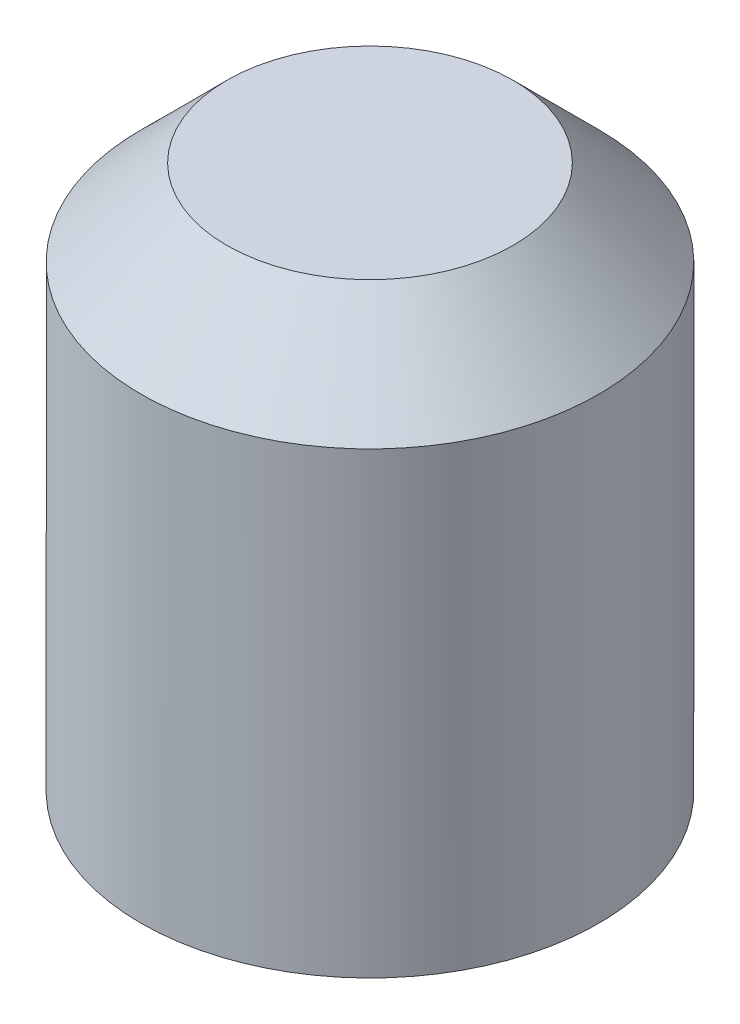
ISO-10303-21;
HEADER;
FILE_DESCRIPTION(('STEP AP214'),'2;1');
FILE_NAME('part.step','',(''),(''),'','','');
FILE_SCHEMA(('AUTOMOTIVE_DESIGN { 1 0 10303 214 1 1 1 1 }'));
ENDSEC;
DATA;
#1=APPLICATION_CONTEXT('core data for automotive mechanical design processes');
#2=APPLICATION_PROTOCOL_DEFINITION('international standard','automotive_design',2000,#1);
#3=PRODUCT_CONTEXT('',#1,'mechanical');
#4=PRODUCT('Part','Part','',(#3));
#5=PRODUCT_RELATED_PRODUCT_CATEGORY('part','',(#4));
#6=PRODUCT_DEFINITION_FORMATION('','',#4);
#7=PRODUCT_DEFINITION_CONTEXT('part definition',#1,'design');
#8=PRODUCT_DEFINITION('design','',#6,#7);
#9=PRODUCT_DEFINITION_SHAPE('','',#8);
#10=(LENGTH_UNIT() NAMED_UNIT(*) SI_UNIT(.MILLI.,.METRE.));
#11=(NAMED_UNIT(*) PLANE_ANGLE_UNIT() SI_UNIT($,.RADIAN.));
#12=(NAMED_UNIT(*) SI_UNIT($,.STERADIAN.) SOLID_ANGLE_UNIT());
#13=UNCERTAINTY_MEASURE_WITH_UNIT(LENGTH_MEASURE(1.E-05),#10,'distance_accuracy_value','');
#14=(GEOMETRIC_REPRESENTATION_CONTEXT(3) GLOBAL_UNCERTAINTY_ASSIGNED_CONTEXT((#13)) GLOBAL_UNIT_ASSIGNED_CONTEXT((#10,
#11,#12)) REPRESENTATION_CONTEXT('',''));
#15=CARTESIAN_POINT('',(0.,0.,0.));
#16=DIRECTION('',(0.,0.,1.));
#17=DIRECTION('',(1.,0.,0.));
#18=AXIS2_PLACEMENT_3D('',#15,#16,#17);
#19=CARTESIAN_POINT('',(7.87735026918963,-10.,1.));
#20=DIRECTION('',(0.,0.,1.));
#21=DIRECTION('',(1.,0.,0.));
#22=AXIS2_PLACEMENT_3D('',#19,#20,#21);
#23=PLANE('',#22);
#24=DIRECTION('',(0.,1.,0.));
#25=VECTOR('',#24,1.);
#26=CARTESIAN_POINT('',(6.72264973081037,-10.,1.));
#27=LINE('',#26,#25);
#28=CARTESIAN_POINT('',(6.72264973079268,-9.99999999997048,1.00000000003064));
#29=VERTEX_POINT('',#28);
#30=CARTESIAN_POINT('',(6.72264973081037,-8.5,1.));
#31=VERTEX_POINT('',#30);
#32=EDGE_CURVE('E74',#29,#31,#27,.T.);
#33=ORIENTED_EDGE('',*,*,#32,.T.);
#34=DIRECTION('',(1.,0.,0.));
#35=VECTOR('',#34,1.);
#36=CARTESIAN_POINT('',(7.3,-8.5,1.));
#37=LINE('',#36,#35);
#38=CARTESIAN_POINT('',(7.87735026918963,-8.5,0.999999999999999));
#39=VERTEX_POINT('',#38);
#40=EDGE_CURVE('E261',#31,#39,#37,.T.);
#41=ORIENTED_EDGE('',*,*,#40,.T.);
#42=DIRECTION('',(0.,1.,0.));
#43=VECTOR('',#42,1.);
#44=CARTESIAN_POINT('',(7.87735026918963,-10.,0.999999999999998));
#45=LINE('',#44,#43);
#46=CARTESIAN_POINT('',(7.87735026920732,-9.99999999997048,1.00000000003064));
#47=VERTEX_POINT('',#46);
#48=EDGE_CURVE('E77',#39,#47,#45,.F.);
#49=ORIENTED_EDGE('',*,*,#48,.T.);
#50=CARTESIAN_POINT('',(6.72264973078712,-9.99999999995726,0.999999999999238));
#51=CARTESIAN_POINT('',(6.77004446289407,-9.98631688639026,0.999999999999726));
#52=CARTESIAN_POINT('',(6.81781412940723,-9.97378960990906,0.999999999999927));
#53=CARTESIAN_POINT('',(6.91412944758816,-9.95164920310437,1.00000000000007));
#54=CARTESIAN_POINT('',(6.96267658444085,-9.94204259300488,1.00000000000002));
#55=CARTESIAN_POINT('',(7.05922611583835,-9.92659400094843,0.999999999999981));
#56=CARTESIAN_POINT('',(7.10721491697941,-9.92066965356561,0.999999999999995));
#57=CARTESIAN_POINT('',(7.2034693839164,-9.91271656859405,1.00000000000001));
#58=CARTESIAN_POINT('',(7.25173469195837,-9.91068360245897,1.));
#59=CARTESIAN_POINT('',(7.34826530804225,-9.91068360245899,0.999999999999999));
#60=CARTESIAN_POINT('',(7.39653061608415,-9.91271656859409,1.));
#61=CARTESIAN_POINT('',(7.49278508302101,-9.92066965356565,1.));
#62=CARTESIAN_POINT('',(7.54077388416201,-9.92659400094847,1.));
#63=CARTESIAN_POINT('',(7.63732341555937,-9.94204259300493,1.));
#64=CARTESIAN_POINT('',(7.68587055241198,-9.95164920310445,1.));
#65=CARTESIAN_POINT('',(7.7821858705928,-9.97378960990902,1.));
#66=CARTESIAN_POINT('',(7.82995553710592,-9.98631688639008,1.));
#67=CARTESIAN_POINT('',(7.87735026921288,-9.99999999995676,1.));
#68=B_SPLINE_CURVE_WITH_KNOTS('',3,(#50,#51,#52,#53,#54,#55,#56,#57,#58,#59,#60,#61,#62,#63,#64,
#65,#66,#67),.UNSPECIFIED.,.F.,.F.,(4,2,2,2,2,2,2,2,4),(0.,0.148036697966093,0.296401493059084,
0.441315429606034,0.586071806689552,0.730828183772874,0.875742120319628,1.02410691541241,
1.17214361337829),.UNSPECIFIED.);
#69=EDGE_CURVE('E21',#29,#47,#68,.T.);
#70=ORIENTED_EDGE('',*,*,#69,.F.);
#71=EDGE_LOOP('',(#33,#41,#49,#70));
#72=FACE_BOUND('',#71,.T.);
#73=ADVANCED_FACE('F17',(#72),#23,.F.);
#74=CARTESIAN_POINT('',(6.72264973081037,-10.,-1.));
#75=DIRECTION('',(0.,0.,-1.));
#76=DIRECTION('',(-1.,0.,0.));
#77=AXIS2_PLACEMENT_3D('',#74,#75,#76);
#78=PLANE('',#77);
#79=DIRECTION('',(0.,1.,0.));
#80=VECTOR('',#79,1.);
#81=CARTESIAN_POINT('',(7.87735026918963,-10.,-1.));
#82=LINE('',#81,#80);
#83=CARTESIAN_POINT('',(7.87735026916594,-9.99999999997385,-1.00000000006128));
#84=VERTEX_POINT('',#83);
#85=CARTESIAN_POINT('',(7.87735026918963,-8.5,-1.));
#86=VERTEX_POINT('',#85);
#87=EDGE_CURVE('E225',#84,#86,#82,.T.);
#88=ORIENTED_EDGE('',*,*,#87,.T.);
#89=DIRECTION('',(1.,0.,0.));
#90=VECTOR('',#89,1.);
#91=CARTESIAN_POINT('',(7.3,-8.5,-1.));
#92=LINE('',#91,#90);
#93=CARTESIAN_POINT('',(6.72264973081037,-8.5,-0.999999999999999));
#94=VERTEX_POINT('',#93);
#95=EDGE_CURVE('E170',#86,#94,#92,.F.);
#96=ORIENTED_EDGE('',*,*,#95,.T.);
#97=DIRECTION('',(0.,1.,0.));
#98=VECTOR('',#97,1.);
#99=CARTESIAN_POINT('',(6.72264973081037,-10.,-0.999999999999998));
#100=LINE('',#99,#98);
#101=CARTESIAN_POINT('',(6.72264973079268,-9.99999999997048,-1.00000000003064));
#102=VERTEX_POINT('',#101);
#103=EDGE_CURVE('E89',#94,#102,#100,.F.);
#104=ORIENTED_EDGE('',*,*,#103,.T.);
#105=CARTESIAN_POINT('',(7.87735026921289,-9.99999999995726,-0.999999999999238));
#106=CARTESIAN_POINT('',(7.82995553710598,-9.98631688639028,-0.999999999999726));
#107=CARTESIAN_POINT('',(7.78218587059287,-9.97378960990909,-0.999999999999927));
#108=CARTESIAN_POINT('',(7.68587055241204,-9.95164920310441,-1.00000000000007));
#109=CARTESIAN_POINT('',(7.63732341555941,-9.94204259300493,-1.00000000000002));
#110=CARTESIAN_POINT('',(7.54077388416201,-9.92659400094848,-0.999999999999981));
#111=CARTESIAN_POINT('',(7.492785083021,-9.92066965356565,-0.999999999999995));
#112=CARTESIAN_POINT('',(7.3965306160841,-9.91271656859408,-1.00000000000001));
#113=CARTESIAN_POINT('',(7.34826530804218,-9.91068360245898,-1.));
#114=CARTESIAN_POINT('',(7.25173469195867,-9.91068360245897,-0.999999999999999));
#115=CARTESIAN_POINT('',(7.20346938391709,-9.91271656859403,-1.));
#116=CARTESIAN_POINT('',(7.10721491698086,-9.92066965356545,-1.));
#117=CARTESIAN_POINT('',(7.05922611584017,-9.92659400094818,-1.));
#118=CARTESIAN_POINT('',(6.96267658444344,-9.94204259300442,-1.));
#119=CARTESIAN_POINT('',(6.91412944759115,-9.9516492031038,-1.));
#120=CARTESIAN_POINT('',(6.81781412941096,-9.97378960990809,-1.));
#121=CARTESIAN_POINT('',(6.77004446289814,-9.98631688638899,-1.));
#122=CARTESIAN_POINT('',(6.72264973079148,-9.9999999999555,-1.));
#123=B_SPLINE_CURVE_WITH_KNOTS('',3,(#105,#106,#107,#108,#109,#110,#111,#112,#113,#114,#115,
#116,#117,#118,#119,#120,#121,#122),.UNSPECIFIED.,.F.,.F.,(4,2,2,2,2,2,2,2,4),(0.,
0.148036697965939,0.296401493058774,0.44131542960558,0.586071806688958,0.730828183771323,
0.875742120317116,1.02410691540888,1.17214361337376),.UNSPECIFIED.);
#124=EDGE_CURVE('E78',#84,#102,#123,.T.);
#125=ORIENTED_EDGE('',*,*,#124,.F.);
#126=EDGE_LOOP('',(#88,#96,#104,#125));
#127=FACE_BOUND('',#126,.T.);
#128=ADVANCED_FACE('F162',(#127),#78,.F.);
#129=CARTESIAN_POINT('',(7.3,-8.5,0.));
#130=DIRECTION('',(0.,1.,0.));
#131=DIRECTION('',(0.,0.,1.));
#132=AXIS2_PLACEMENT_3D('',#129,#130,#131);
#133=PLANE('',#132);
#134=ORIENTED_EDGE('',*,*,#40,.F.);
#135=DIRECTION('',(0.5,0.,0.866025403784439));
#136=VECTOR('',#135,1.);
#137=CARTESIAN_POINT('',(6.72264973081037,-8.5,1.));
#138=LINE('',#137,#136);
#139=CARTESIAN_POINT('',(6.14529946162075,-8.5,0.));
#140=VERTEX_POINT('',#139);
#141=EDGE_CURVE('E88',#31,#140,#138,.F.);
#142=ORIENTED_EDGE('',*,*,#141,.T.);
#143=DIRECTION('',(-0.5,0.,0.866025403784439));
#144=VECTOR('',#143,1.);
#145=CARTESIAN_POINT('',(6.14529946162075,-8.5,0.));
#146=LINE('',#145,#144);
#147=EDGE_CURVE('E251',#140,#94,#146,.F.);
#148=ORIENTED_EDGE('',*,*,#147,.T.);
#149=ORIENTED_EDGE('',*,*,#95,.F.);
#150=DIRECTION('',(-0.5,0.,-0.866025403784439));
#151=VECTOR('',#150,1.);
#152=CARTESIAN_POINT('',(7.87735026918963,-8.5,-1.));
#153=LINE('',#152,#151);
#154=CARTESIAN_POINT('',(8.45470053837925,-8.5,0.));
#155=VERTEX_POINT('',#154);
#156=EDGE_CURVE('E227',#86,#155,#153,.F.);
#157=ORIENTED_EDGE('',*,*,#156,.T.);
#158=DIRECTION('',(0.5,0.,-0.866025403784439));
#159=VECTOR('',#158,1.);
#160=CARTESIAN_POINT('',(8.45470053837925,-8.5,0.));
#161=LINE('',#160,#159);
#162=EDGE_CURVE('E233',#155,#39,#161,.F.);
#163=ORIENTED_EDGE('',*,*,#162,.T.);
#164=EDGE_LOOP('',(#134,#142,#148,#149,#157,#163));
#165=FACE_BOUND('',#164,.T.);
#166=ADVANCED_FACE('F159',(#165),#133,.F.);
#167=CARTESIAN_POINT('',(6.14529946162075,-10.,0.));
#168=DIRECTION('',(-0.866025403784439,0.,-0.5));
#169=DIRECTION('',(-0.5,0.,0.866025403784439));
#170=AXIS2_PLACEMENT_3D('',#167,#168,#169);
#171=PLANE('',#170);
#172=ORIENTED_EDGE('',*,*,#103,.F.);
#173=ORIENTED_EDGE('',*,*,#147,.F.);
#174=DIRECTION('',(0.,1.,0.));
#175=VECTOR('',#174,1.);
#176=CARTESIAN_POINT('',(6.14529946162075,-10.,0.));
#177=LINE('',#176,#175);
#178=CARTESIAN_POINT('',(6.14529946158537,-9.99999999997048,0.));
#179=VERTEX_POINT('',#178);
#180=EDGE_CURVE('E243',#140,#179,#177,.F.);
#181=ORIENTED_EDGE('',*,*,#180,.T.);
#182=CARTESIAN_POINT('',(6.14529946160585,-9.9999999999568,2.26068259120615E-11));
#183=CARTESIAN_POINT('',(6.17067050937847,-9.98534777252046,-0.043943943758777));
#184=CARTESIAN_POINT('',(6.19626055967394,-9.97202233850713,-0.0882672110379299));
#185=CARTESIAN_POINT('',(6.24788373486757,-9.94876319365646,-0.177681173320716));
#186=CARTESIAN_POINT('',(6.27391777671107,-9.93883771012479,-0.222773456520258));
#187=CARTESIAN_POINT('',(6.32566323356824,-9.9233879794276,-0.312399216857905));
#188=CARTESIAN_POINT('',(6.35136668911039,-9.9177608937524,-0.356918907786927));
#189=CARTESIAN_POINT('',(6.40289448034686,-9.91104458401785,-0.446167660210257));
#190=CARTESIAN_POINT('',(6.42871862888019,-9.90994979693902,-0.490896397532203));
#191=CARTESIAN_POINT('',(6.47696828006846,-9.91223314502807,-0.574467244837777));
#192=CARTESIAN_POINT('',(6.49940102297664,-9.91505064255852,-0.613321895307865));
#193=CARTESIAN_POINT('',(6.54412036679037,-9.92397865030937,-0.690778070874386));
#194=CARTESIAN_POINT('',(6.5664068131391,-9.93009220733481,-0.729379328270549));
#195=CARTESIAN_POINT('',(6.61121828301847,-9.94537491662046,-0.806995070863468));
#196=CARTESIAN_POINT('',(6.63373763791393,-9.95460882106108,-0.845999737696072));
#197=CARTESIAN_POINT('',(6.67844056867002,-9.97556588037318,-0.923427485012858));
#198=CARTESIAN_POINT('',(6.70062471678509,-9.98728411433056,-0.96185155667079));
#199=CARTESIAN_POINT('',(6.72264973081985,-9.99999999995552,-1.00000000001641));
#200=B_SPLINE_CURVE_WITH_KNOTS('',3,(#182,#183,#184,#185,#186,#187,#188,#189,#190,#191,#192,
#193,#194,#195,#196,#197,#198,#199),.UNSPECIFIED.,.F.,.F.,(4,2,2,2,2,2,2,2,4),(0.,
0.158508005779459,0.317396908515678,0.47235380307969,0.627120444453223,0.76185389133069,
0.896712096922419,1.03456081128043,1.17213898680438),.UNSPECIFIED.);
#201=EDGE_CURVE('E96',#179,#102,#200,.T.);
#202=ORIENTED_EDGE('',*,*,#201,.T.);
#203=EDGE_LOOP('',(#172,#173,#181,#202));
#204=FACE_BOUND('',#203,.T.);
#205=ADVANCED_FACE('F154',(#204),#171,.F.);
#206=CARTESIAN_POINT('',(6.72264973081037,-10.,1.));
#207=DIRECTION('',(-0.866025403784439,0.,0.5));
#208=DIRECTION('',(0.5,0.,0.866025403784439));
#209=AXIS2_PLACEMENT_3D('',#206,#207,#208);
#210=PLANE('',#209);
#211=ORIENTED_EDGE('',*,*,#180,.F.);
#212=ORIENTED_EDGE('',*,*,#141,.F.);
#213=ORIENTED_EDGE('',*,*,#32,.F.);
#214=CARTESIAN_POINT('',(6.72264973082266,-9.99999999995726,1.00000000001976));
#215=CARTESIAN_POINT('',(6.69727868305058,-9.98534777252003,0.956056056238244));
#216=CARTESIAN_POINT('',(6.67168863275531,-9.97202233850638,0.911732788958994));
#217=CARTESIAN_POINT('',(6.62006545756178,-9.94876319365557,0.822318826676061));
#218=CARTESIAN_POINT('',(6.59403141571818,-9.93883771012409,0.777226543476469));
#219=CARTESIAN_POINT('',(6.54228595886092,-9.92338797942716,0.68760078313874));
#220=CARTESIAN_POINT('',(6.51658250331877,-9.91776089375204,0.643081092209685));
#221=CARTESIAN_POINT('',(6.46505471208228,-9.9110445840177,0.553832339786295));
#222=CARTESIAN_POINT('',(6.43923056354893,-9.909949796939,0.509103602464322));
#223=CARTESIAN_POINT('',(6.39098091236047,-9.91223314502829,0.425532755158426));
#224=CARTESIAN_POINT('',(6.36854816945212,-9.91505064255887,0.386678104688044));
#225=CARTESIAN_POINT('',(6.32382882563806,-9.92397865031003,0.309221929120948));
#226=CARTESIAN_POINT('',(6.30154237928916,-9.93009220733565,0.270620671724504));
#227=CARTESIAN_POINT('',(6.25673090940946,-9.94537491662169,0.193004929131008));
#228=CARTESIAN_POINT('',(6.23421155451383,-9.95460882106252,0.154000262298108));
#229=CARTESIAN_POINT('',(6.1895086237574,-9.97556588037506,0.0765725149807376));
#230=CARTESIAN_POINT('',(6.16732447564216,-9.98728411433266,0.0381484433225167));
#231=CARTESIAN_POINT('',(6.14529946160724,-9.99999999995785,-2.33837581252017E-11));
#232=B_SPLINE_CURVE_WITH_KNOTS('',3,(#214,#215,#216,#217,#218,#219,#220,#221,#222,#223,#224,
#225,#226,#227,#228,#229,#230,#231),.UNSPECIFIED.,.F.,.F.,(4,2,2,2,2,2,2,2,4),(0.,
0.158508005779655,0.317396908516019,0.4723538030801,0.627120444453722,0.76185389133223,
0.896712096924991,1.03456081128413,1.17213898680922),.UNSPECIFIED.);
#233=EDGE_CURVE('E85',#29,#179,#232,.T.);
#234=ORIENTED_EDGE('',*,*,#233,.T.);
#235=EDGE_LOOP('',(#211,#212,#213,#234));
#236=FACE_BOUND('',#235,.T.);
#237=ADVANCED_FACE('F84',(#236),#210,.F.);
#238=CARTESIAN_POINT('',(8.45470053837925,-10.,0.));
#239=DIRECTION('',(0.866025403784439,0.,0.5));
#240=DIRECTION('',(0.5,0.,-0.866025403784439));
#241=AXIS2_PLACEMENT_3D('',#238,#239,#240);
#242=PLANE('',#241);
#243=ORIENTED_EDGE('',*,*,#48,.F.);
#244=ORIENTED_EDGE('',*,*,#162,.F.);
#245=DIRECTION('',(0.,1.,0.));
#246=VECTOR('',#245,1.);
#247=CARTESIAN_POINT('',(8.45470053837925,-10.,0.));
#248=LINE('',#247,#246);
#249=CARTESIAN_POINT('',(8.45470053841463,-9.99999999997048,0.));
#250=VERTEX_POINT('',#249);
#251=EDGE_CURVE('E39',#155,#250,#248,.F.);
#252=ORIENTED_EDGE('',*,*,#251,.T.);
#253=CARTESIAN_POINT('',(8.45470053839415,-9.9999999999568,-2.26077149566126E-11));
#254=CARTESIAN_POINT('',(8.42932949062153,-9.98534777252045,0.0439439437587764));
#255=CARTESIAN_POINT('',(8.40373944032606,-9.97202233850713,0.0882672110379308));
#256=CARTESIAN_POINT('',(8.35211626513242,-9.94876319365646,0.17768117332072));
#257=CARTESIAN_POINT('',(8.32608222328892,-9.93883771012479,0.222773456520264));
#258=CARTESIAN_POINT('',(8.27433676643175,-9.9233879794276,0.312399216857911));
#259=CARTESIAN_POINT('',(8.24863331088961,-9.9177608937524,0.356918907786932));
#260=CARTESIAN_POINT('',(8.19710551965314,-9.91104458401785,0.446167660210259));
#261=CARTESIAN_POINT('',(8.17128137111981,-9.90994979693902,0.490896397532204));
#262=CARTESIAN_POINT('',(8.12303171993136,-9.91223314502808,0.574467244838093));
#263=CARTESIAN_POINT('',(8.100598977023,-9.91505064255856,0.613321895308496));
#264=CARTESIAN_POINT('',(8.0558796332089,-9.92397865030954,0.690778070875643));
#265=CARTESIAN_POINT('',(8.03359318685999,-9.93009220733507,0.729379328272117));
#266=CARTESIAN_POINT('',(7.98878171698026,-9.94537491662094,0.806995070865664));
#267=CARTESIAN_POINT('',(7.96626236208462,-9.9546088210617,0.845999737698585));
#268=CARTESIAN_POINT('',(7.92155943132817,-9.9755658803741,0.923427485015994));
#269=CARTESIAN_POINT('',(7.89937528321292,-9.98728411433164,0.961851556674232));
#270=CARTESIAN_POINT('',(7.87735026917799,-9.99999999995677,1.00000000002015));
#271=B_SPLINE_CURVE_WITH_KNOTS('',3,(#253,#254,#255,#256,#257,#258,#259,#260,#261,#262,#263,
#264,#265,#266,#267,#268,#269,#270),.UNSPECIFIED.,.F.,.F.,(4,2,2,2,2,2,2,2,4),(0.,
0.158508005779463,0.317396908515688,0.472353803079696,0.627120444453223,0.761853891331786,
0.896712096924613,1.03456081128378,1.17213898680888),.UNSPECIFIED.);
#272=EDGE_CURVE('E95',#250,#47,#271,.T.);
#273=ORIENTED_EDGE('',*,*,#272,.T.);
#274=EDGE_LOOP('',(#243,#244,#252,#273));
#275=FACE_BOUND('',#274,.T.);
#276=ADVANCED_FACE('F153',(#275),#242,.F.);
#277=CARTESIAN_POINT('',(7.87735026918963,-10.,-1.));
#278=DIRECTION('',(0.866025403784439,0.,-0.5));
#279=DIRECTION('',(-0.5,0.,-0.866025403784439));
#280=AXIS2_PLACEMENT_3D('',#277,#278,#279);
#281=PLANE('',#280);
#282=ORIENTED_EDGE('',*,*,#251,.F.);
#283=ORIENTED_EDGE('',*,*,#156,.F.);
#284=ORIENTED_EDGE('',*,*,#87,.F.);
#285=CARTESIAN_POINT('',(7.87735026917734,-9.99999999995726,-1.00000000001976));
#286=CARTESIAN_POINT('',(7.90272131694942,-9.98534777252003,-0.956056056238243));
#287=CARTESIAN_POINT('',(7.92831136724469,-9.97202233850638,-0.911732788958993));
#288=CARTESIAN_POINT('',(7.97993454243822,-9.94876319365557,-0.82231882667606));
#289=CARTESIAN_POINT('',(8.00596858428182,-9.93883771012409,-0.777226543476468));
#290=CARTESIAN_POINT('',(8.05771404113909,-9.92338797942716,-0.687600783138739));
#291=CARTESIAN_POINT('',(8.08341749668123,-9.91776089375204,-0.643081092209684));
#292=CARTESIAN_POINT('',(8.13494528791772,-9.9110445840177,-0.553832339786295));
#293=CARTESIAN_POINT('',(8.16076943645107,-9.909949796939,-0.509103602464322));
#294=CARTESIAN_POINT('',(8.20901908763954,-9.91223314502829,-0.425532755158426));
#295=CARTESIAN_POINT('',(8.23145183054788,-9.91505064255887,-0.386678104688044));
#296=CARTESIAN_POINT('',(8.27617117436194,-9.92397865031003,-0.309221929120948));
#297=CARTESIAN_POINT('',(8.29845762071083,-9.93009220733565,-0.270620671724505));
#298=CARTESIAN_POINT('',(8.34326909059054,-9.94537491662169,-0.193004929131009));
#299=CARTESIAN_POINT('',(8.36578844548617,-9.95460882106252,-0.154000262298109));
#300=CARTESIAN_POINT('',(8.4104913762426,-9.97556588037506,-0.0765725149807391));
#301=CARTESIAN_POINT('',(8.43267552435784,-9.98728411433266,-0.0381484433225182));
#302=CARTESIAN_POINT('',(8.45470053839276,-9.99999999995785,2.33826176742176E-11));
#303=B_SPLINE_CURVE_WITH_KNOTS('',3,(#285,#286,#287,#288,#289,#290,#291,#292,#293,#294,#295,
#296,#297,#298,#299,#300,#301,#302),.UNSPECIFIED.,.F.,.F.,(4,2,2,2,2,2,2,2,4),(0.,
0.158508005779655,0.31739690851602,0.4723538030801,0.627120444453721,0.761853891332229,
0.896712096924989,1.03456081128413,1.17213898680922),.UNSPECIFIED.);
#304=EDGE_CURVE('E109',#84,#250,#303,.T.);
#305=ORIENTED_EDGE('',*,*,#304,.T.);
#306=EDGE_LOOP('',(#282,#283,#284,#305));
#307=FACE_BOUND('',#306,.T.);
#308=ADVANCED_FACE('F121',(#307),#281,.F.);
#309=CARTESIAN_POINT('',(7.3,-9.99999999999091,0.));
#310=DIRECTION('',(0.,-1.,0.));
#311=DIRECTION('',(0.,0.,-1.));
#312=AXIS2_PLACEMENT_3D('',#309,#310,#311);
#313=CONICAL_SURFACE('',#312,1.15470053845001,1.04719755112858);
#314=ORIENTED_EDGE('',*,*,#124,.T.);
#315=CARTESIAN_POINT('',(7.3,-9.99999999995809,0.));
#316=DIRECTION('',(0.,-1.,0.));
#317=DIRECTION('',(0.,0.,-1.));
#318=AXIS2_PLACEMENT_3D('',#315,#316,#317);
#319=CIRCLE('',#318,1.15470053839317);
#320=EDGE_CURVE('E104',#84,#102,#319,.F.);
#321=ORIENTED_EDGE('',*,*,#320,.F.);
#322=EDGE_LOOP('',(#314,#321));
#323=FACE_BOUND('',#322,.T.);
#324=ADVANCED_FACE('F171',(#323),#313,.F.);
#325=CARTESIAN_POINT('',(7.3,-9.99999999999091,0.));
#326=DIRECTION('',(0.,-1.,0.));
#327=DIRECTION('',(0.,0.,-1.));
#328=AXIS2_PLACEMENT_3D('',#325,#326,#327);
#329=CONICAL_SURFACE('',#328,1.15470053845001,1.04719755120501);
#330=CARTESIAN_POINT('',(7.3,-9.99999999999091,0.));
#331=DIRECTION('',(0.,-1.,0.));
#332=DIRECTION('',(0.,0.,-1.));
#333=AXIS2_PLACEMENT_3D('',#330,#331,#332);
#334=CIRCLE('',#333,1.15470053845001);
#335=EDGE_CURVE('E102',#102,#179,#334,.F.);
#336=ORIENTED_EDGE('',*,*,#335,.F.);
#337=ORIENTED_EDGE('',*,*,#201,.F.);
#338=EDGE_LOOP('',(#336,#337));
#339=FACE_BOUND('',#338,.T.);
#340=ADVANCED_FACE('F140',(#339),#329,.F.);
#341=CARTESIAN_POINT('',(7.3,-9.99999999999091,0.));
#342=DIRECTION('',(0.,-1.,0.));
#343=DIRECTION('',(0.,0.,-1.));
#344=AXIS2_PLACEMENT_3D('',#341,#342,#343);
#345=CONICAL_SURFACE('',#344,1.15470053845001,1.04719755120501);
#346=CARTESIAN_POINT('',(7.3,-9.99999999999091,0.));
#347=DIRECTION('',(0.,-1.,0.));
#348=DIRECTION('',(0.,0.,-1.));
#349=AXIS2_PLACEMENT_3D('',#346,#347,#348);
#350=CIRCLE('',#349,1.15470053845001);
#351=EDGE_CURVE('E67',#179,#29,#350,.F.);
#352=ORIENTED_EDGE('',*,*,#351,.F.);
#353=ORIENTED_EDGE('',*,*,#233,.F.);
#354=EDGE_LOOP('',(#352,#353));
#355=FACE_BOUND('',#354,.T.);
#356=ADVANCED_FACE('F93',(#355),#345,.F.);
#357=CARTESIAN_POINT('',(7.3,-9.99999999999091,0.));
#358=DIRECTION('',(0.,-1.,0.));
#359=DIRECTION('',(0.,0.,-1.));
#360=AXIS2_PLACEMENT_3D('',#357,#358,#359);
#361=CONICAL_SURFACE('',#360,1.15470053845001,1.04719755112858);
#362=ORIENTED_EDGE('',*,*,#69,.T.);
#363=CARTESIAN_POINT('',(7.3,-9.99999999999091,0.));
#364=DIRECTION('',(0.,-1.,0.));
#365=DIRECTION('',(0.,0.,-1.));
#366=AXIS2_PLACEMENT_3D('',#363,#364,#365);
#367=CIRCLE('',#366,1.15470053845002);
#368=EDGE_CURVE('E59',#29,#47,#367,.F.);
#369=ORIENTED_EDGE('',*,*,#368,.F.);
#370=EDGE_LOOP('',(#362,#369));
#371=FACE_BOUND('',#370,.T.);
#372=ADVANCED_FACE('F61',(#371),#361,.F.);
#373=CARTESIAN_POINT('',(7.3,-9.99999999999091,0.));
#374=DIRECTION('',(0.,-1.,0.));
#375=DIRECTION('',(0.,0.,-1.));
#376=AXIS2_PLACEMENT_3D('',#373,#374,#375);
#377=CONICAL_SURFACE('',#376,1.15470053845001,1.04719755120501);
#378=CARTESIAN_POINT('',(7.3,-9.99999999999091,0.));
#379=DIRECTION('',(0.,-1.,0.));
#380=DIRECTION('',(0.,0.,-1.));
#381=AXIS2_PLACEMENT_3D('',#378,#379,#380);
#382=CIRCLE('',#381,1.15470053845001);
#383=EDGE_CURVE('E66',#47,#250,#382,.F.);
#384=ORIENTED_EDGE('',*,*,#383,.F.);
#385=ORIENTED_EDGE('',*,*,#272,.F.);
#386=EDGE_LOOP('',(#384,#385));
#387=FACE_BOUND('',#386,.T.);
#388=ADVANCED_FACE('F128',(#387),#377,.F.);
#389=CARTESIAN_POINT('',(7.3,-9.99999999999091,0.));
#390=DIRECTION('',(0.,-1.,0.));
#391=DIRECTION('',(0.,0.,-1.));
#392=AXIS2_PLACEMENT_3D('',#389,#390,#391);
#393=CONICAL_SURFACE('',#392,1.15470053845001,1.04719755120501);
#394=CARTESIAN_POINT('',(7.3,-9.99999999999091,0.));
#395=DIRECTION('',(0.,-1.,0.));
#396=DIRECTION('',(0.,0.,-1.));
#397=AXIS2_PLACEMENT_3D('',#394,#395,#396);
#398=CIRCLE('',#397,1.15470053845001);
#399=EDGE_CURVE('E211',#250,#84,#398,.F.);
#400=ORIENTED_EDGE('',*,*,#399,.F.);
#401=ORIENTED_EDGE('',*,*,#304,.F.);
#402=EDGE_LOOP('',(#400,#401));
#403=FACE_BOUND('',#402,.T.);
#404=ADVANCED_FACE('F124',(#403),#393,.F.);
#405=CARTESIAN_POINT('',(7.3,-10.,-1.36260026918963));
#406=DIRECTION('',(0.,-1.,0.));
#407=DIRECTION('',(0.,0.,-1.));
#408=AXIS2_PLACEMENT_3D('',#405,#406,#407);
#409=PLANE('',#408);
#410=ORIENTED_EDGE('',*,*,#383,.T.);
#411=ORIENTED_EDGE('',*,*,#399,.T.);
#412=ORIENTED_EDGE('',*,*,#320,.T.);
#413=ORIENTED_EDGE('',*,*,#335,.T.);
#414=ORIENTED_EDGE('',*,*,#351,.T.);
#415=ORIENTED_EDGE('',*,*,#368,.T.);
#416=EDGE_LOOP('',(#410,#411,#412,#413,#414,#415));
#417=FACE_BOUND('',#416,.T.);
#418=CARTESIAN_POINT('',(7.3,-10.0000000000149,0.));
#419=DIRECTION('',(0.,1.,0.));
#420=DIRECTION('',(0.,0.,1.));
#421=AXIS2_PLACEMENT_3D('',#418,#419,#420);
#422=CIRCLE('',#421,1.57050000012759);
#423=CARTESIAN_POINT('',(7.3,-10.0000000000149,1.57050000012759));
#424=VERTEX_POINT('',#423);
#425=EDGE_CURVE('E207',#424,#424,#422,.T.);
#426=ORIENTED_EDGE('',*,*,#425,.F.);
#427=EDGE_LOOP('',(#426));
#428=FACE_BOUND('',#427,.T.);
#429=ADVANCED_FACE('F98',(#417,#428),#409,.T.);
#430=CARTESIAN_POINT('',(7.3,-5.,-0.625));
#431=DIRECTION('',(0.,1.,0.));
#432=DIRECTION('',(0.,0.,1.));
#433=AXIS2_PLACEMENT_3D('',#430,#431,#432);
#434=PLANE('',#433);
#435=CARTESIAN_POINT('',(7.3,-5.00000000016598,0.));
#436=DIRECTION('',(0.,-1.,0.));
#437=DIRECTION('',(0.,0.,-1.));
#438=AXIS2_PLACEMENT_3D('',#435,#436,#437);
#439=CIRCLE('',#438,1.25000000014097);
#440=CARTESIAN_POINT('',(7.3,-5.00000000016598,-1.25000000014097));
#441=VERTEX_POINT('',#440);
#442=EDGE_CURVE('E206',#441,#441,#439,.T.);
#443=ORIENTED_EDGE('',*,*,#442,.F.);
#444=EDGE_LOOP('',(#443));
#445=FACE_BOUND('',#444,.T.);
#446=ADVANCED_FACE('F197',(#445),#434,.T.);
#447=CARTESIAN_POINT('',(7.3,-9.75202805938125,0.));
#448=DIRECTION('',(0.,1.,0.));
#449=DIRECTION('',(0.,0.,1.));
#450=AXIS2_PLACEMENT_3D('',#447,#448,#449);
#451=CONICAL_SURFACE('',#450,2.00000000012324,1.04719755116297);
#452=ORIENTED_EDGE('',*,*,#425,.T.);
#453=EDGE_LOOP('',(#452));
#454=FACE_BOUND('',#453,.T.);
#455=CARTESIAN_POINT('',(7.3,-9.75202805938306,0.));
#456=DIRECTION('',(0.,-1.,0.));
#457=DIRECTION('',(0.,0.,-1.));
#458=AXIS2_PLACEMENT_3D('',#455,#456,#457);
#459=CIRCLE('',#458,2.);
#460=CARTESIAN_POINT('',(7.3,-9.75202805938306,-2.));
#461=VERTEX_POINT('',#460);
#462=EDGE_CURVE('E31',#461,#461,#459,.F.);
#463=ORIENTED_EDGE('',*,*,#462,.F.);
#464=EDGE_LOOP('',(#463));
#465=FACE_BOUND('',#464,.T.);
#466=ADVANCED_FACE('F190',(#454,#465),#451,.T.);
#467=CARTESIAN_POINT('',(7.3,-5.74999999992087,0.));
#468=DIRECTION('',(0.,-1.,0.));
#469=DIRECTION('',(0.,0.,-1.));
#470=AXIS2_PLACEMENT_3D('',#467,#468,#469);
#471=CONICAL_SURFACE('',#470,1.99999999995271,0.785398163435344);
#472=ORIENTED_EDGE('',*,*,#442,.T.);
#473=EDGE_LOOP('',(#472));
#474=FACE_BOUND('',#473,.T.);
#475=CARTESIAN_POINT('',(7.3,-5.75,0.));
#476=DIRECTION('',(0.,-1.,0.));
#477=DIRECTION('',(0.,0.,-1.));
#478=AXIS2_PLACEMENT_3D('',#475,#476,#477);
#479=CIRCLE('',#478,2.);
#480=CARTESIAN_POINT('',(7.3,-5.75,-2.));
#481=VERTEX_POINT('',#480);
#482=EDGE_CURVE('E11',#481,#481,#479,.T.);
#483=ORIENTED_EDGE('',*,*,#482,.F.);
#484=EDGE_LOOP('',(#483));
#485=FACE_BOUND('',#484,.T.);
#486=ADVANCED_FACE('F184',(#474,#485),#471,.T.);
#487=CARTESIAN_POINT('',(7.3,-7.75101402969153,0.));
#488=DIRECTION('',(0.,-1.,0.));
#489=DIRECTION('',(0.,0.,-1.));
#490=AXIS2_PLACEMENT_3D('',#487,#488,#489);
#491=CYLINDRICAL_SURFACE('',#490,2.);
#492=ORIENTED_EDGE('',*,*,#462,.T.);
#493=EDGE_LOOP('',(#492));
#494=FACE_BOUND('',#493,.T.);
#495=ORIENTED_EDGE('',*,*,#482,.T.);
#496=EDGE_LOOP('',(#495));
#497=FACE_BOUND('',#496,.T.);
#498=ADVANCED_FACE('F182',(#494,#497),#491,.T.);
#499=CLOSED_SHELL('',(#73,#128,#166,#205,#237,#276,#308,#324,#340,#356,#372,#388,#404,#429,#446,
#466,#486,#498));
#500=MANIFOLD_SOLID_BREP('B1',#499);
#501=ADVANCED_BREP_SHAPE_REPRESENTATION('',(#18,#500),#14);
#502=SHAPE_DEFINITION_REPRESENTATION(#9,#501);
ENDSEC;
END-ISO-10303-21;
